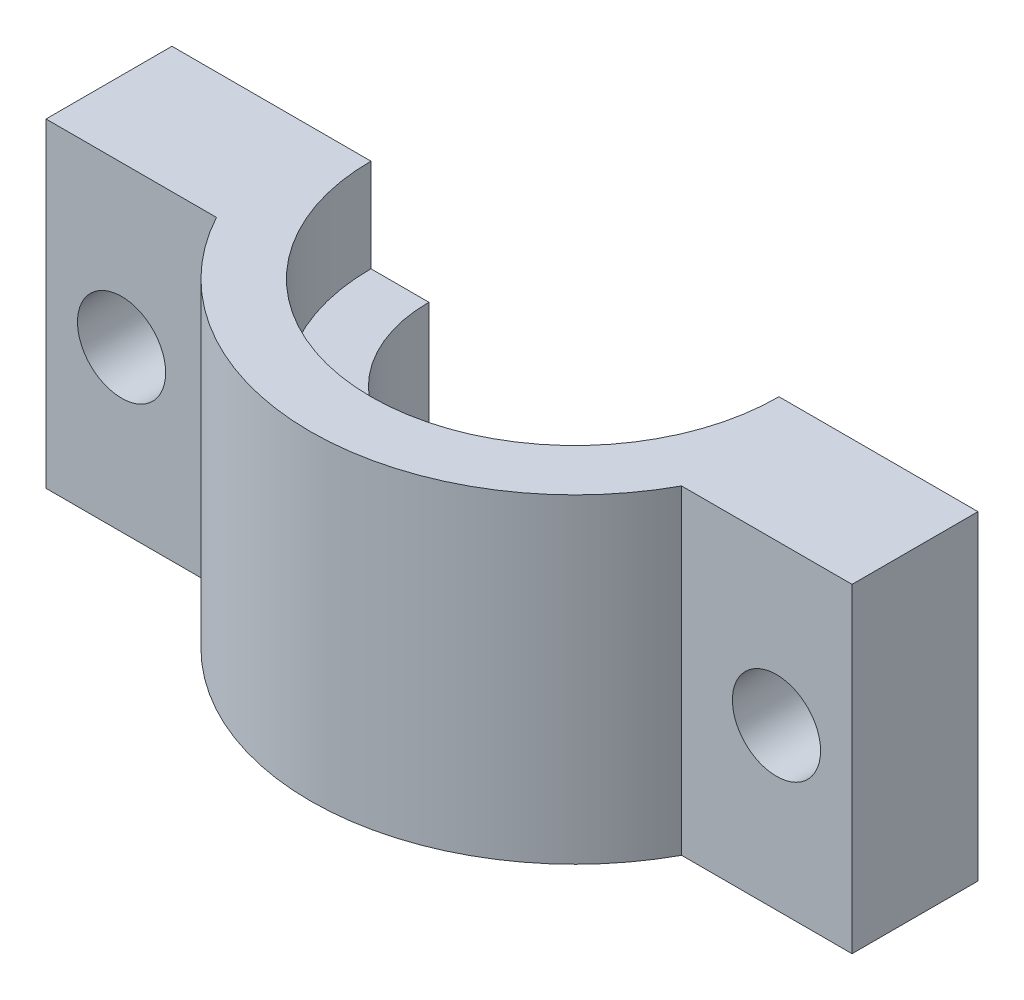
ISO-10303-21;
HEADER;
FILE_DESCRIPTION(('STEP AP214'),'2;1');
FILE_NAME('part.step','',(''),(''),'','','');
FILE_SCHEMA(('AUTOMOTIVE_DESIGN { 1 0 10303 214 1 1 1 1 }'));
ENDSEC;
DATA;
#1=APPLICATION_CONTEXT('core data for automotive mechanical design processes');
#2=APPLICATION_PROTOCOL_DEFINITION('international standard','automotive_design',2000,#1);
#3=PRODUCT_CONTEXT('',#1,'mechanical');
#4=PRODUCT('Part','Part','',(#3));
#5=PRODUCT_RELATED_PRODUCT_CATEGORY('part','',(#4));
#6=PRODUCT_DEFINITION_FORMATION('','',#4);
#7=PRODUCT_DEFINITION_CONTEXT('part definition',#1,'design');
#8=PRODUCT_DEFINITION('design','',#6,#7);
#9=PRODUCT_DEFINITION_SHAPE('','',#8);
#10=(LENGTH_UNIT() NAMED_UNIT(*) SI_UNIT(.MILLI.,.METRE.));
#11=(NAMED_UNIT(*) PLANE_ANGLE_UNIT() SI_UNIT($,.RADIAN.));
#12=(NAMED_UNIT(*) SI_UNIT($,.STERADIAN.) SOLID_ANGLE_UNIT());
#13=UNCERTAINTY_MEASURE_WITH_UNIT(LENGTH_MEASURE(1.E-05),#10,'distance_accuracy_value','');
#14=(GEOMETRIC_REPRESENTATION_CONTEXT(3) GLOBAL_UNCERTAINTY_ASSIGNED_CONTEXT((#13)) GLOBAL_UNIT_ASSIGNED_CONTEXT((#10,
#11,#12)) REPRESENTATION_CONTEXT('',''));
#15=CARTESIAN_POINT('',(0.,0.,0.));
#16=DIRECTION('',(0.,0.,1.));
#17=DIRECTION('',(1.,0.,0.));
#18=AXIS2_PLACEMENT_3D('',#15,#16,#17);
#19=CARTESIAN_POINT('',(0.,0.,0.));
#20=DIRECTION('',(0.,0.,1.));
#21=DIRECTION('',(1.,0.,0.));
#22=AXIS2_PLACEMENT_3D('',#19,#20,#21);
#23=PLANE('',#22);
#24=CARTESIAN_POINT('',(13.,0.,0.));
#25=DIRECTION('',(0.,0.,1.));
#26=DIRECTION('',(1.,0.,0.));
#27=AXIS2_PLACEMENT_3D('',#24,#25,#26);
#28=CIRCLE('',#27,1.75);
#29=CARTESIAN_POINT('',(14.75,0.,0.));
#30=VERTEX_POINT('',#29);
#31=EDGE_CURVE('E276',#30,#30,#28,.T.);
#32=ORIENTED_EDGE('',*,*,#31,.T.);
#33=EDGE_LOOP('',(#32));
#34=FACE_BOUND('',#33,.T.);
#35=DIRECTION('',(1.,0.,0.));
#36=VECTOR('',#35,1.);
#37=CARTESIAN_POINT('',(0.,2.65,0.));
#38=LINE('',#37,#36);
#39=CARTESIAN_POINT('',(5.8,2.65,0.));
#40=VERTEX_POINT('',#39);
#41=CARTESIAN_POINT('',(8.1,2.65,0.));
#42=VERTEX_POINT('',#41);
#43=EDGE_CURVE('E41',#40,#42,#38,.T.);
#44=ORIENTED_EDGE('',*,*,#43,.T.);
#45=DIRECTION('',(0.,1.,0.));
#46=VECTOR('',#45,1.);
#47=CARTESIAN_POINT('',(8.1,6.35,0.));
#48=LINE('',#47,#46);
#49=CARTESIAN_POINT('',(8.1,6.35,0.));
#50=VERTEX_POINT('',#49);
#51=EDGE_CURVE('E11',#42,#50,#48,.T.);
#52=ORIENTED_EDGE('',*,*,#51,.T.);
#53=DIRECTION('',(-1.,0.,0.));
#54=VECTOR('',#53,1.);
#55=CARTESIAN_POINT('',(-16.,6.35,0.));
#56=LINE('',#55,#54);
#57=CARTESIAN_POINT('',(16.,6.35,0.));
#58=VERTEX_POINT('',#57);
#59=EDGE_CURVE('E177',#58,#50,#56,.T.);
#60=ORIENTED_EDGE('',*,*,#59,.F.);
#61=DIRECTION('',(0.,1.,0.));
#62=VECTOR('',#61,1.);
#63=CARTESIAN_POINT('',(16.,6.35,0.));
#64=LINE('',#63,#62);
#65=CARTESIAN_POINT('',(16.,-6.35,0.));
#66=VERTEX_POINT('',#65);
#67=EDGE_CURVE('E173',#66,#58,#64,.T.);
#68=ORIENTED_EDGE('',*,*,#67,.F.);
#69=DIRECTION('',(1.,0.,0.));
#70=VECTOR('',#69,1.);
#71=CARTESIAN_POINT('',(-16.,-6.35,0.));
#72=LINE('',#71,#70);
#73=CARTESIAN_POINT('',(8.1,-6.35,0.));
#74=VERTEX_POINT('',#73);
#75=EDGE_CURVE('E183',#74,#66,#72,.T.);
#76=ORIENTED_EDGE('',*,*,#75,.F.);
#77=DIRECTION('',(0.,1.,0.));
#78=VECTOR('',#77,1.);
#79=CARTESIAN_POINT('',(8.1,6.35,0.));
#80=LINE('',#79,#78);
#81=CARTESIAN_POINT('',(8.1,-3.35,0.));
#82=VERTEX_POINT('',#81);
#83=EDGE_CURVE('E210',#74,#82,#80,.T.);
#84=ORIENTED_EDGE('',*,*,#83,.T.);
#85=DIRECTION('',(-1.,0.,0.));
#86=VECTOR('',#85,1.);
#87=CARTESIAN_POINT('',(0.,-3.35,0.));
#88=LINE('',#87,#86);
#89=CARTESIAN_POINT('',(5.8,-3.35,0.));
#90=VERTEX_POINT('',#89);
#91=EDGE_CURVE('E201',#82,#90,#88,.T.);
#92=ORIENTED_EDGE('',*,*,#91,.T.);
#93=DIRECTION('',(0.,1.,0.));
#94=VECTOR('',#93,1.);
#95=CARTESIAN_POINT('',(5.8,6.35,0.));
#96=LINE('',#95,#94);
#97=EDGE_CURVE('E212',#90,#40,#96,.T.);
#98=ORIENTED_EDGE('',*,*,#97,.T.);
#99=EDGE_LOOP('',(#44,#52,#60,#68,#76,#84,#92,#98));
#100=FACE_BOUND('',#99,.T.);
#101=ADVANCED_FACE('F33',(#34,#100),#23,.F.);
#102=CARTESIAN_POINT('',(16.,6.35,12.));
#103=DIRECTION('',(-1.,0.,0.));
#104=DIRECTION('',(0.,0.,1.));
#105=AXIS2_PLACEMENT_3D('',#102,#103,#104);
#106=PLANE('',#105);
#107=DIRECTION('',(0.,0.,-1.));
#108=VECTOR('',#107,1.);
#109=CARTESIAN_POINT('',(16.,6.35,12.));
#110=LINE('',#109,#108);
#111=CARTESIAN_POINT('',(16.,6.35,5.));
#112=VERTEX_POINT('',#111);
#113=EDGE_CURVE('E193',#112,#58,#110,.T.);
#114=ORIENTED_EDGE('',*,*,#113,.F.);
#115=DIRECTION('',(0.,1.,0.));
#116=VECTOR('',#115,1.);
#117=CARTESIAN_POINT('',(16.,-6.35,5.));
#118=LINE('',#117,#116);
#119=CARTESIAN_POINT('',(16.,-6.35,5.));
#120=VERTEX_POINT('',#119);
#121=EDGE_CURVE('E155',#120,#112,#118,.T.);
#122=ORIENTED_EDGE('',*,*,#121,.F.);
#123=DIRECTION('',(0.,0.,-1.));
#124=VECTOR('',#123,1.);
#125=CARTESIAN_POINT('',(16.,-6.35,12.));
#126=LINE('',#125,#124);
#127=EDGE_CURVE('E187',#120,#66,#126,.T.);
#128=ORIENTED_EDGE('',*,*,#127,.T.);
#129=ORIENTED_EDGE('',*,*,#67,.T.);
#130=EDGE_LOOP('',(#114,#122,#128,#129));
#131=FACE_BOUND('',#130,.T.);
#132=ADVANCED_FACE('F35',(#131),#106,.F.);
#133=CARTESIAN_POINT('',(-16.,6.35,12.));
#134=DIRECTION('',(0.,-1.,0.));
#135=DIRECTION('',(0.,0.,-1.));
#136=AXIS2_PLACEMENT_3D('',#133,#134,#135);
#137=PLANE('',#136);
#138=CARTESIAN_POINT('',(0.,6.35,0.));
#139=DIRECTION('',(0.,-1.,0.));
#140=DIRECTION('',(0.,0.,1.));
#141=AXIS2_PLACEMENT_3D('',#138,#139,#140);
#142=CIRCLE('',#141,10.5);
#143=CARTESIAN_POINT('',(9.23309265630969,6.35,5.));
#144=VERTEX_POINT('',#143);
#145=CARTESIAN_POINT('',(-9.23309265630969,6.35,5.));
#146=VERTEX_POINT('',#145);
#147=EDGE_CURVE('E129',#144,#146,#142,.T.);
#148=ORIENTED_EDGE('',*,*,#147,.F.);
#149=DIRECTION('',(-1.,0.,0.));
#150=VECTOR('',#149,1.);
#151=CARTESIAN_POINT('',(9.23309265630969,6.35,5.));
#152=LINE('',#151,#150);
#153=EDGE_CURVE('E140',#112,#144,#152,.T.);
#154=ORIENTED_EDGE('',*,*,#153,.F.);
#155=ORIENTED_EDGE('',*,*,#113,.T.);
#156=ORIENTED_EDGE('',*,*,#59,.T.);
#157=CARTESIAN_POINT('',(0.,6.35,0.));
#158=DIRECTION('',(0.,1.,0.));
#159=DIRECTION('',(0.,0.,1.));
#160=AXIS2_PLACEMENT_3D('',#157,#158,#159);
#161=CIRCLE('',#160,8.1);
#162=CARTESIAN_POINT('',(-8.1,6.35,0.));
#163=VERTEX_POINT('',#162);
#164=EDGE_CURVE('E171',#163,#50,#161,.T.);
#165=ORIENTED_EDGE('',*,*,#164,.F.);
#166=CARTESIAN_POINT('',(-16.,6.35,0.));
#167=VERTEX_POINT('',#166);
#168=EDGE_CURVE('E176',#163,#167,#56,.T.);
#169=ORIENTED_EDGE('',*,*,#168,.T.);
#170=DIRECTION('',(0.,0.,-1.));
#171=VECTOR('',#170,1.);
#172=CARTESIAN_POINT('',(-16.,6.35,12.));
#173=LINE('',#172,#171);
#174=CARTESIAN_POINT('',(-16.,6.35,5.));
#175=VERTEX_POINT('',#174);
#176=EDGE_CURVE('E191',#175,#167,#173,.T.);
#177=ORIENTED_EDGE('',*,*,#176,.F.);
#178=DIRECTION('',(-1.,0.,0.));
#179=VECTOR('',#178,1.);
#180=CARTESIAN_POINT('',(-16.,6.35,5.));
#181=LINE('',#180,#179);
#182=EDGE_CURVE('E143',#146,#175,#181,.T.);
#183=ORIENTED_EDGE('',*,*,#182,.F.);
#184=EDGE_LOOP('',(#148,#154,#155,#156,#165,#169,#177,#183));
#185=FACE_BOUND('',#184,.T.);
#186=ADVANCED_FACE('F235',(#185),#137,.F.);
#187=CARTESIAN_POINT('',(-16.,6.35,12.));
#188=DIRECTION('',(1.,0.,0.));
#189=DIRECTION('',(0.,0.,-1.));
#190=AXIS2_PLACEMENT_3D('',#187,#188,#189);
#191=PLANE('',#190);
#192=DIRECTION('',(0.,0.,-1.));
#193=VECTOR('',#192,1.);
#194=CARTESIAN_POINT('',(-16.,-6.35,12.));
#195=LINE('',#194,#193);
#196=CARTESIAN_POINT('',(-16.,-6.35,5.));
#197=VERTEX_POINT('',#196);
#198=CARTESIAN_POINT('',(-16.,-6.35,0.));
#199=VERTEX_POINT('',#198);
#200=EDGE_CURVE('E189',#197,#199,#195,.T.);
#201=ORIENTED_EDGE('',*,*,#200,.F.);
#202=DIRECTION('',(0.,1.,0.));
#203=VECTOR('',#202,1.);
#204=CARTESIAN_POINT('',(-16.,-6.35,5.));
#205=LINE('',#204,#203);
#206=EDGE_CURVE('E48',#197,#175,#205,.T.);
#207=ORIENTED_EDGE('',*,*,#206,.T.);
#208=ORIENTED_EDGE('',*,*,#176,.T.);
#209=DIRECTION('',(0.,-1.,0.));
#210=VECTOR('',#209,1.);
#211=CARTESIAN_POINT('',(-16.,6.35,0.));
#212=LINE('',#211,#210);
#213=EDGE_CURVE('E180',#167,#199,#212,.T.);
#214=ORIENTED_EDGE('',*,*,#213,.T.);
#215=EDGE_LOOP('',(#201,#207,#208,#214));
#216=FACE_BOUND('',#215,.T.);
#217=ADVANCED_FACE('F230',(#216),#191,.F.);
#218=CARTESIAN_POINT('',(-16.,-6.35,12.));
#219=DIRECTION('',(0.,1.,0.));
#220=DIRECTION('',(0.,0.,1.));
#221=AXIS2_PLACEMENT_3D('',#218,#219,#220);
#222=PLANE('',#221);
#223=ORIENTED_EDGE('',*,*,#127,.F.);
#224=DIRECTION('',(-1.,0.,0.));
#225=VECTOR('',#224,1.);
#226=CARTESIAN_POINT('',(9.23309265630969,-6.35,5.));
#227=LINE('',#226,#225);
#228=CARTESIAN_POINT('',(9.23309265630969,-6.35,5.));
#229=VERTEX_POINT('',#228);
#230=EDGE_CURVE('E131',#120,#229,#227,.T.);
#231=ORIENTED_EDGE('',*,*,#230,.T.);
#232=CARTESIAN_POINT('',(0.,-6.35,0.));
#233=DIRECTION('',(0.,-1.,0.));
#234=DIRECTION('',(0.,0.,1.));
#235=AXIS2_PLACEMENT_3D('',#232,#233,#234);
#236=CIRCLE('',#235,10.5);
#237=CARTESIAN_POINT('',(-9.23309265630969,-6.35,5.));
#238=VERTEX_POINT('',#237);
#239=EDGE_CURVE('E126',#229,#238,#236,.T.);
#240=ORIENTED_EDGE('',*,*,#239,.T.);
#241=DIRECTION('',(-1.,0.,0.));
#242=VECTOR('',#241,1.);
#243=CARTESIAN_POINT('',(-16.,-6.35,5.));
#244=LINE('',#243,#242);
#245=EDGE_CURVE('E133',#238,#197,#244,.T.);
#246=ORIENTED_EDGE('',*,*,#245,.T.);
#247=ORIENTED_EDGE('',*,*,#200,.T.);
#248=CARTESIAN_POINT('',(-8.1,-6.35,0.));
#249=VERTEX_POINT('',#248);
#250=EDGE_CURVE('E184',#199,#249,#72,.T.);
#251=ORIENTED_EDGE('',*,*,#250,.T.);
#252=CARTESIAN_POINT('',(0.,-6.35,0.));
#253=DIRECTION('',(0.,1.,0.));
#254=DIRECTION('',(0.,0.,1.));
#255=AXIS2_PLACEMENT_3D('',#252,#253,#254);
#256=CIRCLE('',#255,8.1);
#257=EDGE_CURVE('E56',#249,#74,#256,.T.);
#258=ORIENTED_EDGE('',*,*,#257,.T.);
#259=ORIENTED_EDGE('',*,*,#75,.T.);
#260=EDGE_LOOP('',(#223,#231,#240,#246,#247,#251,#258,#259));
#261=FACE_BOUND('',#260,.T.);
#262=ADVANCED_FACE('F139',(#261),#222,.F.);
#263=CARTESIAN_POINT('',(-13.,0.,0.));
#264=DIRECTION('',(0.,0.,1.));
#265=DIRECTION('',(1.,0.,0.));
#266=AXIS2_PLACEMENT_3D('',#263,#264,#265);
#267=CIRCLE('',#266,1.75);
#268=CARTESIAN_POINT('',(-11.25,0.,0.));
#269=VERTEX_POINT('',#268);
#270=EDGE_CURVE('E151',#269,#269,#267,.T.);
#271=ORIENTED_EDGE('',*,*,#270,.T.);
#272=EDGE_LOOP('',(#271));
#273=FACE_BOUND('',#272,.T.);
#274=ORIENTED_EDGE('',*,*,#168,.F.);
#275=DIRECTION('',(0.,1.,0.));
#276=VECTOR('',#275,1.);
#277=CARTESIAN_POINT('',(-8.1,6.35,0.));
#278=LINE('',#277,#276);
#279=CARTESIAN_POINT('',(-8.1,2.65,0.));
#280=VERTEX_POINT('',#279);
#281=EDGE_CURVE('E207',#163,#280,#278,.F.);
#282=ORIENTED_EDGE('',*,*,#281,.T.);
#283=CARTESIAN_POINT('',(-5.8,2.65,0.));
#284=VERTEX_POINT('',#283);
#285=EDGE_CURVE('E204',#280,#284,#38,.T.);
#286=ORIENTED_EDGE('',*,*,#285,.T.);
#287=DIRECTION('',(0.,1.,0.));
#288=VECTOR('',#287,1.);
#289=CARTESIAN_POINT('',(-5.8,6.35,0.));
#290=LINE('',#289,#288);
#291=CARTESIAN_POINT('',(-5.8,-3.35,0.));
#292=VERTEX_POINT('',#291);
#293=EDGE_CURVE('E200',#284,#292,#290,.F.);
#294=ORIENTED_EDGE('',*,*,#293,.T.);
#295=CARTESIAN_POINT('',(-8.1,-3.35,0.));
#296=VERTEX_POINT('',#295);
#297=EDGE_CURVE('E197',#292,#296,#88,.T.);
#298=ORIENTED_EDGE('',*,*,#297,.T.);
#299=DIRECTION('',(0.,1.,0.));
#300=VECTOR('',#299,1.);
#301=CARTESIAN_POINT('',(-8.1,6.35,0.));
#302=LINE('',#301,#300);
#303=EDGE_CURVE('E195',#296,#249,#302,.F.);
#304=ORIENTED_EDGE('',*,*,#303,.T.);
#305=ORIENTED_EDGE('',*,*,#250,.F.);
#306=ORIENTED_EDGE('',*,*,#213,.F.);
#307=EDGE_LOOP('',(#274,#282,#286,#294,#298,#304,#305,#306));
#308=FACE_BOUND('',#307,.T.);
#309=ADVANCED_FACE('F226',(#273,#308),#23,.F.);
#310=CARTESIAN_POINT('',(0.,6.35,0.));
#311=DIRECTION('',(0.,1.,0.));
#312=DIRECTION('',(0.,0.,1.));
#313=AXIS2_PLACEMENT_3D('',#310,#311,#312);
#314=CYLINDRICAL_SURFACE('',#313,8.1);
#315=CARTESIAN_POINT('',(0.,2.65,0.));
#316=DIRECTION('',(0.,1.,0.));
#317=DIRECTION('',(0.,0.,1.));
#318=AXIS2_PLACEMENT_3D('',#315,#316,#317);
#319=CIRCLE('',#318,8.1);
#320=EDGE_CURVE('E168',#280,#42,#319,.T.);
#321=ORIENTED_EDGE('',*,*,#320,.F.);
#322=ORIENTED_EDGE('',*,*,#281,.F.);
#323=ORIENTED_EDGE('',*,*,#164,.T.);
#324=ORIENTED_EDGE('',*,*,#51,.F.);
#325=EDGE_LOOP('',(#321,#322,#323,#324));
#326=FACE_BOUND('',#325,.T.);
#327=ADVANCED_FACE('F239',(#326),#314,.F.);
#328=CARTESIAN_POINT('',(0.,2.65,8.1));
#329=DIRECTION('',(0.,-1.,0.));
#330=DIRECTION('',(0.,0.,-1.));
#331=AXIS2_PLACEMENT_3D('',#328,#329,#330);
#332=PLANE('',#331);
#333=ORIENTED_EDGE('',*,*,#320,.T.);
#334=ORIENTED_EDGE('',*,*,#43,.F.);
#335=CARTESIAN_POINT('',(0.,2.65,0.));
#336=DIRECTION('',(0.,1.,0.));
#337=DIRECTION('',(0.,0.,1.));
#338=AXIS2_PLACEMENT_3D('',#335,#336,#337);
#339=CIRCLE('',#338,5.8);
#340=EDGE_CURVE('E165',#284,#40,#339,.T.);
#341=ORIENTED_EDGE('',*,*,#340,.F.);
#342=ORIENTED_EDGE('',*,*,#285,.F.);
#343=EDGE_LOOP('',(#333,#334,#341,#342));
#344=FACE_BOUND('',#343,.T.);
#345=ADVANCED_FACE('F243',(#344),#332,.F.);
#346=CARTESIAN_POINT('',(0.,6.35,0.));
#347=DIRECTION('',(0.,1.,0.));
#348=DIRECTION('',(0.,0.,1.));
#349=AXIS2_PLACEMENT_3D('',#346,#347,#348);
#350=CYLINDRICAL_SURFACE('',#349,5.8);
#351=CARTESIAN_POINT('',(0.,-3.35,0.));
#352=DIRECTION('',(0.,1.,0.));
#353=DIRECTION('',(0.,0.,1.));
#354=AXIS2_PLACEMENT_3D('',#351,#352,#353);
#355=CIRCLE('',#354,5.8);
#356=EDGE_CURVE('E162',#292,#90,#355,.T.);
#357=ORIENTED_EDGE('',*,*,#356,.F.);
#358=ORIENTED_EDGE('',*,*,#293,.F.);
#359=ORIENTED_EDGE('',*,*,#340,.T.);
#360=ORIENTED_EDGE('',*,*,#97,.F.);
#361=EDGE_LOOP('',(#357,#358,#359,#360));
#362=FACE_BOUND('',#361,.T.);
#363=ADVANCED_FACE('F245',(#362),#350,.F.);
#364=CARTESIAN_POINT('',(0.,-3.35,5.8));
#365=DIRECTION('',(0.,1.,0.));
#366=DIRECTION('',(0.,0.,1.));
#367=AXIS2_PLACEMENT_3D('',#364,#365,#366);
#368=PLANE('',#367);
#369=CARTESIAN_POINT('',(0.,-3.35,0.));
#370=DIRECTION('',(0.,1.,0.));
#371=DIRECTION('',(0.,0.,1.));
#372=AXIS2_PLACEMENT_3D('',#369,#370,#371);
#373=CIRCLE('',#372,8.1);
#374=EDGE_CURVE('E159',#296,#82,#373,.T.);
#375=ORIENTED_EDGE('',*,*,#374,.F.);
#376=ORIENTED_EDGE('',*,*,#297,.F.);
#377=ORIENTED_EDGE('',*,*,#356,.T.);
#378=ORIENTED_EDGE('',*,*,#91,.F.);
#379=EDGE_LOOP('',(#375,#376,#377,#378));
#380=FACE_BOUND('',#379,.T.);
#381=ADVANCED_FACE('F220',(#380),#368,.F.);
#382=CARTESIAN_POINT('',(0.,6.35,0.));
#383=DIRECTION('',(0.,1.,0.));
#384=DIRECTION('',(0.,0.,1.));
#385=AXIS2_PLACEMENT_3D('',#382,#383,#384);
#386=CYLINDRICAL_SURFACE('',#385,8.1);
#387=ORIENTED_EDGE('',*,*,#257,.F.);
#388=ORIENTED_EDGE('',*,*,#303,.F.);
#389=ORIENTED_EDGE('',*,*,#374,.T.);
#390=ORIENTED_EDGE('',*,*,#83,.F.);
#391=EDGE_LOOP('',(#387,#388,#389,#390));
#392=FACE_BOUND('',#391,.T.);
#393=ADVANCED_FACE('F222',(#392),#386,.F.);
#394=CARTESIAN_POINT('',(0.,-6.35,0.));
#395=DIRECTION('',(0.,1.,0.));
#396=DIRECTION('',(0.,0.,1.));
#397=AXIS2_PLACEMENT_3D('',#394,#395,#396);
#398=CYLINDRICAL_SURFACE('',#397,10.5);
#399=ORIENTED_EDGE('',*,*,#147,.T.);
#400=DIRECTION('',(0.,1.,0.));
#401=VECTOR('',#400,1.);
#402=CARTESIAN_POINT('',(-9.23309265630969,-6.35,5.));
#403=LINE('',#402,#401);
#404=EDGE_CURVE('E123',#238,#146,#403,.T.);
#405=ORIENTED_EDGE('',*,*,#404,.F.);
#406=ORIENTED_EDGE('',*,*,#239,.F.);
#407=DIRECTION('',(0.,1.,0.));
#408=VECTOR('',#407,1.);
#409=CARTESIAN_POINT('',(9.23309265630969,-6.35,5.));
#410=LINE('',#409,#408);
#411=EDGE_CURVE('E153',#229,#144,#410,.T.);
#412=ORIENTED_EDGE('',*,*,#411,.T.);
#413=EDGE_LOOP('',(#399,#405,#406,#412));
#414=FACE_BOUND('',#413,.T.);
#415=ADVANCED_FACE('F124',(#414),#398,.T.);
#416=CARTESIAN_POINT('',(9.23309265630969,-6.35,5.));
#417=DIRECTION('',(0.,0.,-1.));
#418=DIRECTION('',(-1.,0.,0.));
#419=AXIS2_PLACEMENT_3D('',#416,#417,#418);
#420=PLANE('',#419);
#421=CARTESIAN_POINT('',(13.,0.,5.));
#422=DIRECTION('',(0.,0.,1.));
#423=DIRECTION('',(1.,0.,0.));
#424=AXIS2_PLACEMENT_3D('',#421,#422,#423);
#425=CIRCLE('',#424,1.75);
#426=CARTESIAN_POINT('',(14.75,0.,5.));
#427=VERTEX_POINT('',#426);
#428=EDGE_CURVE('E146',#427,#427,#425,.T.);
#429=ORIENTED_EDGE('',*,*,#428,.F.);
#430=EDGE_LOOP('',(#429));
#431=FACE_BOUND('',#430,.T.);
#432=ORIENTED_EDGE('',*,*,#153,.T.);
#433=ORIENTED_EDGE('',*,*,#411,.F.);
#434=ORIENTED_EDGE('',*,*,#230,.F.);
#435=ORIENTED_EDGE('',*,*,#121,.T.);
#436=EDGE_LOOP('',(#432,#433,#434,#435));
#437=FACE_BOUND('',#436,.T.);
#438=ADVANCED_FACE('F284',(#431,#437),#420,.F.);
#439=CARTESIAN_POINT('',(-16.,-6.35,5.));
#440=DIRECTION('',(0.,0.,-1.));
#441=DIRECTION('',(-1.,0.,0.));
#442=AXIS2_PLACEMENT_3D('',#439,#440,#441);
#443=PLANE('',#442);
#444=CARTESIAN_POINT('',(-13.,0.,5.));
#445=DIRECTION('',(0.,0.,1.));
#446=DIRECTION('',(1.,0.,0.));
#447=AXIS2_PLACEMENT_3D('',#444,#445,#446);
#448=CIRCLE('',#447,1.75);
#449=CARTESIAN_POINT('',(-11.25,0.,5.));
#450=VERTEX_POINT('',#449);
#451=EDGE_CURVE('E273',#450,#450,#448,.T.);
#452=ORIENTED_EDGE('',*,*,#451,.F.);
#453=EDGE_LOOP('',(#452));
#454=FACE_BOUND('',#453,.T.);
#455=ORIENTED_EDGE('',*,*,#182,.T.);
#456=ORIENTED_EDGE('',*,*,#206,.F.);
#457=ORIENTED_EDGE('',*,*,#245,.F.);
#458=ORIENTED_EDGE('',*,*,#404,.T.);
#459=EDGE_LOOP('',(#455,#456,#457,#458));
#460=FACE_BOUND('',#459,.T.);
#461=ADVANCED_FACE('F134',(#454,#460),#443,.F.);
#462=CARTESIAN_POINT('',(-13.,0.,0.));
#463=DIRECTION('',(0.,0.,1.));
#464=DIRECTION('',(1.,0.,0.));
#465=AXIS2_PLACEMENT_3D('',#462,#463,#464);
#466=CYLINDRICAL_SURFACE('',#465,1.75);
#467=ORIENTED_EDGE('',*,*,#270,.F.);
#468=EDGE_LOOP('',(#467));
#469=FACE_BOUND('',#468,.T.);
#470=ORIENTED_EDGE('',*,*,#451,.T.);
#471=EDGE_LOOP('',(#470));
#472=FACE_BOUND('',#471,.T.);
#473=ADVANCED_FACE('F295',(#469,#472),#466,.F.);
#474=CARTESIAN_POINT('',(13.,0.,0.));
#475=DIRECTION('',(0.,0.,1.));
#476=DIRECTION('',(1.,0.,0.));
#477=AXIS2_PLACEMENT_3D('',#474,#475,#476);
#478=CYLINDRICAL_SURFACE('',#477,1.75);
#479=ORIENTED_EDGE('',*,*,#31,.F.);
#480=EDGE_LOOP('',(#479));
#481=FACE_BOUND('',#480,.T.);
#482=ORIENTED_EDGE('',*,*,#428,.T.);
#483=EDGE_LOOP('',(#482));
#484=FACE_BOUND('',#483,.T.);
#485=ADVANCED_FACE('F282',(#481,#484),#478,.F.);
#486=CLOSED_SHELL('',(#101,#132,#186,#217,#262,#309,#327,#345,#363,#381,#393,#415,#438,#461,
#473,#485));
#487=MANIFOLD_SOLID_BREP('B2',#486);
#488=ADVANCED_BREP_SHAPE_REPRESENTATION('',(#18,#487),#14);
#489=SHAPE_DEFINITION_REPRESENTATION(#9,#488);
ENDSEC;
END-ISO-10303-21;
